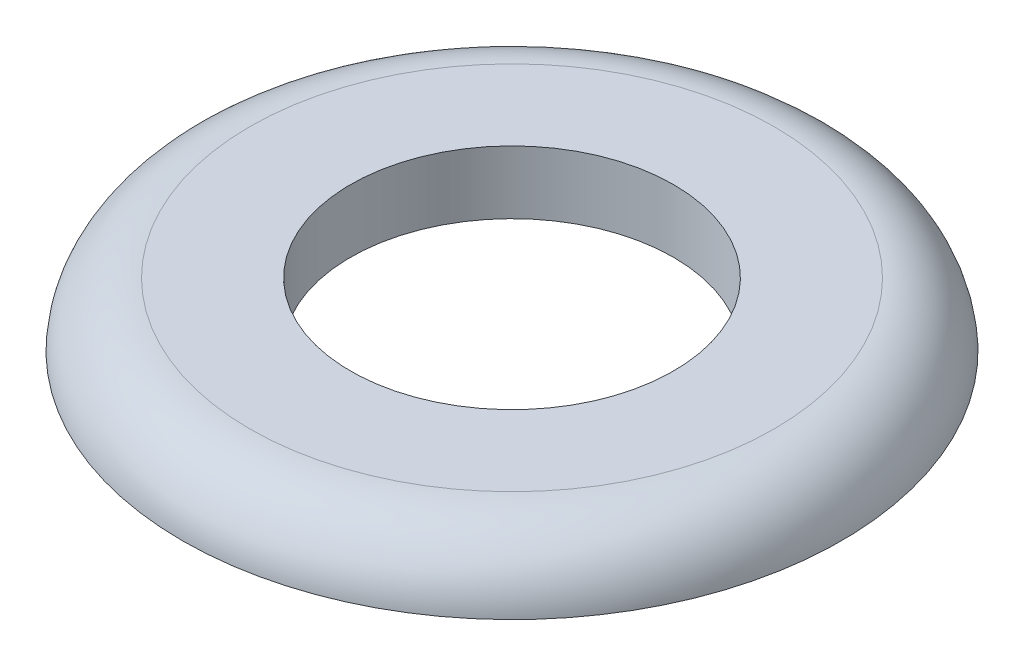
ISO-10303-21;
HEADER;
FILE_DESCRIPTION(('STEP AP214'),'2;1');
FILE_NAME('part.step','',(''),(''),'','','');
FILE_SCHEMA(('AUTOMOTIVE_DESIGN { 1 0 10303 214 1 1 1 1 }'));
ENDSEC;
DATA;
#1=APPLICATION_CONTEXT('core data for automotive mechanical design processes');
#2=APPLICATION_PROTOCOL_DEFINITION('international standard','automotive_design',2000,#1);
#3=PRODUCT_CONTEXT('',#1,'mechanical');
#4=PRODUCT('Part','Part','',(#3));
#5=PRODUCT_RELATED_PRODUCT_CATEGORY('part','',(#4));
#6=PRODUCT_DEFINITION_FORMATION('','',#4);
#7=PRODUCT_DEFINITION_CONTEXT('part definition',#1,'design');
#8=PRODUCT_DEFINITION('design','',#6,#7);
#9=PRODUCT_DEFINITION_SHAPE('','',#8);
#10=(LENGTH_UNIT() NAMED_UNIT(*) SI_UNIT(.MILLI.,.METRE.));
#11=(NAMED_UNIT(*) PLANE_ANGLE_UNIT() SI_UNIT($,.RADIAN.));
#12=(NAMED_UNIT(*) SI_UNIT($,.STERADIAN.) SOLID_ANGLE_UNIT());
#13=UNCERTAINTY_MEASURE_WITH_UNIT(LENGTH_MEASURE(1.E-05),#10,'distance_accuracy_value','');
#14=(GEOMETRIC_REPRESENTATION_CONTEXT(3) GLOBAL_UNCERTAINTY_ASSIGNED_CONTEXT((#13)) GLOBAL_UNIT_ASSIGNED_CONTEXT((#10,
#11,#12)) REPRESENTATION_CONTEXT('',''));
#15=CARTESIAN_POINT('',(0.,0.,0.));
#16=DIRECTION('',(0.,0.,1.));
#17=DIRECTION('',(1.,0.,0.));
#18=AXIS2_PLACEMENT_3D('',#15,#16,#17);
#19=CARTESIAN_POINT('',(0.,7.7089,-4.23333333333418));
#20=DIRECTION('',(0.,1.,0.));
#21=DIRECTION('',(0.,0.,1.));
#22=AXIS2_PLACEMENT_3D('',#19,#20,#21);
#23=PLANE('',#22);
#24=CARTESIAN_POINT('',(0.,7.7089,0.));
#25=DIRECTION('',(0.,-1.,0.));
#26=DIRECTION('',(0.,0.,-1.));
#27=AXIS2_PLACEMENT_3D('',#24,#25,#26);
#28=CIRCLE('',#27,2.60990835569736);
#29=CARTESIAN_POINT('',(0.,7.7089,-2.60990835569736));
#30=VERTEX_POINT('',#29);
#31=EDGE_CURVE('E44',#30,#30,#28,.T.);
#32=ORIENTED_EDGE('',*,*,#31,.T.);
#33=EDGE_LOOP('',(#32));
#34=FACE_BOUND('',#33,.T.);
#35=CARTESIAN_POINT('',(0.,7.70890000000076,0.));
#36=DIRECTION('',(0.,-1.,0.));
#37=DIRECTION('',(0.,0.,1.));
#38=AXIS2_PLACEMENT_3D('',#35,#36,#37);
#39=CIRCLE('',#38,4.23333333333418);
#40=CARTESIAN_POINT('',(0.,7.70890000000046,4.23333333333418));
#41=VERTEX_POINT('',#40);
#42=CARTESIAN_POINT('',(0.,7.70890000000046,-4.23333333333418));
#43=VERTEX_POINT('',#42);
#44=EDGE_CURVE('E34',#41,#43,#39,.T.);
#45=ORIENTED_EDGE('',*,*,#44,.F.);
#46=CARTESIAN_POINT('',(0.,7.70890000000076,0.));
#47=DIRECTION('',(0.,-1.,0.));
#48=DIRECTION('',(0.,0.,-1.));
#49=AXIS2_PLACEMENT_3D('',#46,#47,#48);
#50=CIRCLE('',#49,4.23333333333418);
#51=EDGE_CURVE('E38',#43,#41,#50,.T.);
#52=ORIENTED_EDGE('',*,*,#51,.F.);
#53=EDGE_LOOP('',(#45,#52));
#54=FACE_BOUND('',#53,.T.);
#55=ADVANCED_FACE('F17',(#34,#54),#23,.T.);
#56=CARTESIAN_POINT('',(0.,6.61458333333418,0.));
#57=DIRECTION('',(0.,-1.,0.));
#58=DIRECTION('',(0.,0.,-1.));
#59=AXIS2_PLACEMENT_3D('',#56,#57,#58);
#60=TOROIDAL_SURFACE('',#59,4.23333333333418,1.09431666666658);
#61=CARTESIAN_POINT('',(0.,6.69078333333418,0.));
#62=DIRECTION('',(0.,-1.,0.));
#63=DIRECTION('',(0.,0.,-1.));
#64=AXIS2_PLACEMENT_3D('',#61,#62,#63);
#65=CIRCLE('',#64,5.32499377822731);
#66=CARTESIAN_POINT('',(0.,6.69078333333418,-5.32499377822731));
#67=VERTEX_POINT('',#66);
#68=EDGE_CURVE('E28',#67,#67,#65,.T.);
#69=ORIENTED_EDGE('',*,*,#68,.F.);
#70=EDGE_LOOP('',(#69));
#71=FACE_BOUND('',#70,.T.);
#72=ORIENTED_EDGE('',*,*,#51,.T.);
#73=ORIENTED_EDGE('',*,*,#44,.T.);
#74=EDGE_LOOP('',(#72,#73));
#75=FACE_BOUND('',#74,.T.);
#76=ADVANCED_FACE('F43',(#71,#75),#60,.T.);
#77=CARTESIAN_POINT('',(0.,6.69078333333418,0.));
#78=DIRECTION('',(0.,-1.,0.));
#79=DIRECTION('',(0.,0.,-1.));
#80=AXIS2_PLACEMENT_3D('',#77,#78,#79);
#81=CYLINDRICAL_SURFACE('',#80,2.60990835569736);
#82=CARTESIAN_POINT('',(0.,6.69078333333418,0.));
#83=DIRECTION('',(0.,-1.,0.));
#84=DIRECTION('',(0.,0.,-1.));
#85=AXIS2_PLACEMENT_3D('',#82,#83,#84);
#86=CIRCLE('',#85,2.60990835569736);
#87=CARTESIAN_POINT('',(0.,6.69078333333418,-2.60990835569736));
#88=VERTEX_POINT('',#87);
#89=EDGE_CURVE('E11',#88,#88,#86,.F.);
#90=ORIENTED_EDGE('',*,*,#89,.F.);
#91=EDGE_LOOP('',(#90));
#92=FACE_BOUND('',#91,.T.);
#93=ORIENTED_EDGE('',*,*,#31,.F.);
#94=EDGE_LOOP('',(#93));
#95=FACE_BOUND('',#94,.T.);
#96=ADVANCED_FACE('F60',(#92,#95),#81,.F.);
#97=CARTESIAN_POINT('',(0.,6.69078333333418,-2.60990835569736));
#98=DIRECTION('',(0.,-1.,0.));
#99=DIRECTION('',(0.,0.,-1.));
#100=AXIS2_PLACEMENT_3D('',#97,#98,#99);
#101=PLANE('',#100);
#102=ORIENTED_EDGE('',*,*,#89,.T.);
#103=EDGE_LOOP('',(#102));
#104=FACE_BOUND('',#103,.T.);
#105=ORIENTED_EDGE('',*,*,#68,.T.);
#106=EDGE_LOOP('',(#105));
#107=FACE_BOUND('',#106,.T.);
#108=ADVANCED_FACE('F66',(#104,#107),#101,.T.);
#109=CLOSED_SHELL('',(#55,#76,#96,#108));
#110=MANIFOLD_SOLID_BREP('B1',#109);
#111=ADVANCED_BREP_SHAPE_REPRESENTATION('',(#18,#110),#14);
#112=SHAPE_DEFINITION_REPRESENTATION(#9,#111);
ENDSEC;
END-ISO-10303-21;
